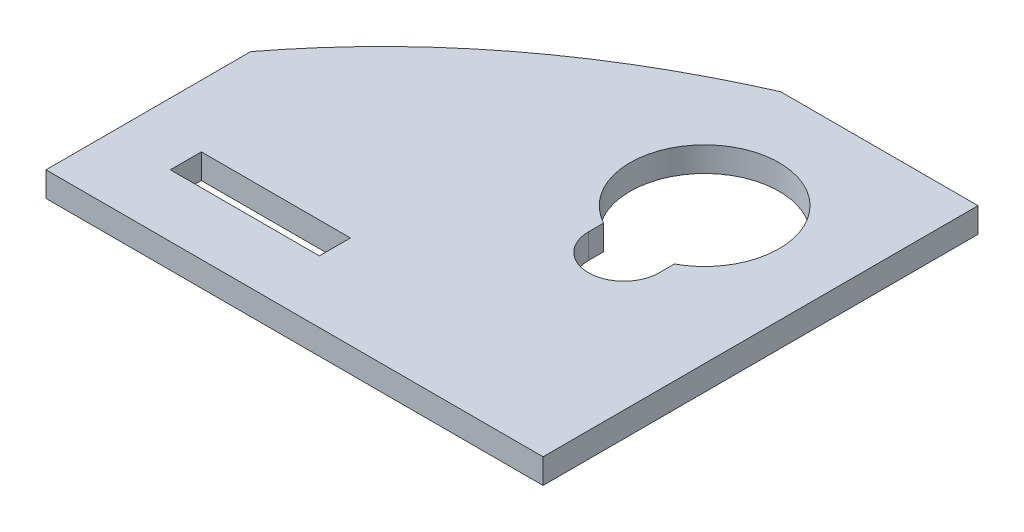
ISO-10303-21;
HEADER;
FILE_DESCRIPTION(('STEP AP214'),'2;1');
FILE_NAME('part.step','',(''),(''),'','','');
FILE_SCHEMA(('AUTOMOTIVE_DESIGN { 1 0 10303 214 1 1 1 1 }'));
ENDSEC;
DATA;
#1=APPLICATION_CONTEXT('core data for automotive mechanical design processes');
#2=APPLICATION_PROTOCOL_DEFINITION('international standard','automotive_design',2000,#1);
#3=PRODUCT_CONTEXT('',#1,'mechanical');
#4=PRODUCT('Part','Part','',(#3));
#5=PRODUCT_RELATED_PRODUCT_CATEGORY('part','',(#4));
#6=PRODUCT_DEFINITION_FORMATION('','',#4);
#7=PRODUCT_DEFINITION_CONTEXT('part definition',#1,'design');
#8=PRODUCT_DEFINITION('design','',#6,#7);
#9=PRODUCT_DEFINITION_SHAPE('','',#8);
#10=(LENGTH_UNIT() NAMED_UNIT(*) SI_UNIT(.MILLI.,.METRE.));
#11=(NAMED_UNIT(*) PLANE_ANGLE_UNIT() SI_UNIT($,.RADIAN.));
#12=(NAMED_UNIT(*) SI_UNIT($,.STERADIAN.) SOLID_ANGLE_UNIT());
#13=UNCERTAINTY_MEASURE_WITH_UNIT(LENGTH_MEASURE(1.E-05),#10,'distance_accuracy_value','');
#14=(GEOMETRIC_REPRESENTATION_CONTEXT(3) GLOBAL_UNCERTAINTY_ASSIGNED_CONTEXT((#13)) GLOBAL_UNIT_ASSIGNED_CONTEXT((#10,
#11,#12)) REPRESENTATION_CONTEXT('',''));
#15=CARTESIAN_POINT('',(0.,0.,0.));
#16=DIRECTION('',(0.,0.,1.));
#17=DIRECTION('',(1.,0.,0.));
#18=AXIS2_PLACEMENT_3D('',#15,#16,#17);
#19=CARTESIAN_POINT('',(0.,2.,0.));
#20=DIRECTION('',(0.,-1.,0.));
#21=DIRECTION('',(0.,0.,-1.));
#22=AXIS2_PLACEMENT_3D('',#19,#20,#21);
#23=PLANE('',#22);
#24=CARTESIAN_POINT('',(9.00000000000001,2.,0.));
#25=DIRECTION('',(0.,1.,0.));
#26=DIRECTION('',(0.,0.,1.));
#27=AXIS2_PLACEMENT_3D('',#24,#25,#26);
#28=CIRCLE('',#27,2.85);
#29=CARTESIAN_POINT('',(6.15000000000001,2.,0.));
#30=VERTEX_POINT('',#29);
#31=CARTESIAN_POINT('',(11.85,2.,0.));
#32=VERTEX_POINT('',#31);
#33=EDGE_CURVE('E212',#30,#32,#28,.T.);
#34=ORIENTED_EDGE('',*,*,#33,.F.);
#35=DIRECTION('',(0.,0.,1.));
#36=VECTOR('',#35,1.);
#37=CARTESIAN_POINT('',(6.15000000000001,2.,-1.2200852279606));
#38=LINE('',#37,#36);
#39=CARTESIAN_POINT('',(6.15000000000001,2.,-1.2200852279606));
#40=VERTEX_POINT('',#39);
#41=EDGE_CURVE('E220',#40,#30,#38,.T.);
#42=ORIENTED_EDGE('',*,*,#41,.F.);
#43=CARTESIAN_POINT('',(9.00000000000001,2.,-6.50000000000001));
#44=DIRECTION('',(0.,1.,0.));
#45=DIRECTION('',(0.,0.,1.));
#46=AXIS2_PLACEMENT_3D('',#43,#44,#45);
#47=CIRCLE('',#46,6.);
#48=CARTESIAN_POINT('',(11.85,2.,-1.2200852279606));
#49=VERTEX_POINT('',#48);
#50=EDGE_CURVE('E217',#49,#40,#47,.T.);
#51=ORIENTED_EDGE('',*,*,#50,.F.);
#52=DIRECTION('',(0.,0.,-1.));
#53=VECTOR('',#52,1.);
#54=CARTESIAN_POINT('',(11.85,2.,-1.2200852279606));
#55=LINE('',#54,#53);
#56=EDGE_CURVE('E214',#32,#49,#55,.T.);
#57=ORIENTED_EDGE('',*,*,#56,.F.);
#58=EDGE_LOOP('',(#34,#42,#51,#57));
#59=FACE_BOUND('',#58,.T.);
#60=DIRECTION('',(-1.,0.,0.));
#61=VECTOR('',#60,1.);
#62=CARTESIAN_POINT('',(-20.,2.,-17.5));
#63=LINE('',#62,#61);
#64=CARTESIAN_POINT('',(20.,2.,-17.5));
#65=VERTEX_POINT('',#64);
#66=CARTESIAN_POINT('',(4.11660053716541,2.,-17.5));
#67=VERTEX_POINT('',#66);
#68=EDGE_CURVE('E137',#65,#67,#63,.T.);
#69=ORIENTED_EDGE('',*,*,#68,.T.);
#70=CARTESIAN_POINT('',(-28.7452278888274,2.,17.5));
#71=CARTESIAN_POINT('',(-20.2628649110153,2.,-6.72067736772361));
#72=CARTESIAN_POINT('',(4.11660053716541,2.,-17.5));
#73=B_SPLINE_CURVE_WITH_KNOTS('',2,(#70,#71,#72),.UNSPECIFIED.,.F.,.F.,(3,3),(0.,1.),.UNSPECIFIED.);
#74=CARTESIAN_POINT('',(-20.0000000004594,2.,1.02915013489577));
#75=VERTEX_POINT('',#74);
#76=EDGE_CURVE('E125',#75,#67,#73,.T.);
#77=ORIENTED_EDGE('',*,*,#76,.F.);
#78=DIRECTION('',(0.,0.,1.));
#79=VECTOR('',#78,1.);
#80=CARTESIAN_POINT('',(-20.,2.,17.5));
#81=LINE('',#80,#79);
#82=CARTESIAN_POINT('',(-20.,2.,17.5));
#83=VERTEX_POINT('',#82);
#84=EDGE_CURVE('E145',#75,#83,#81,.T.);
#85=ORIENTED_EDGE('',*,*,#84,.T.);
#86=DIRECTION('',(1.,0.,0.));
#87=VECTOR('',#86,1.);
#88=CARTESIAN_POINT('',(-20.,2.,17.5));
#89=LINE('',#88,#87);
#90=CARTESIAN_POINT('',(20.,2.,17.5));
#91=VERTEX_POINT('',#90);
#92=EDGE_CURVE('E147',#83,#91,#89,.T.);
#93=ORIENTED_EDGE('',*,*,#92,.T.);
#94=DIRECTION('',(0.,0.,-1.));
#95=VECTOR('',#94,1.);
#96=CARTESIAN_POINT('',(20.,2.,17.5));
#97=LINE('',#96,#95);
#98=EDGE_CURVE('E143',#91,#65,#97,.T.);
#99=ORIENTED_EDGE('',*,*,#98,.T.);
#100=EDGE_LOOP('',(#69,#77,#85,#93,#99));
#101=FACE_BOUND('',#100,.T.);
#102=DIRECTION('',(0.,0.,1.));
#103=VECTOR('',#102,1.);
#104=CARTESIAN_POINT('',(-15.,2.,12.5));
#105=LINE('',#104,#103);
#106=CARTESIAN_POINT('',(-15.,2.,9.99999999999999));
#107=VERTEX_POINT('',#106);
#108=CARTESIAN_POINT('',(-15.,2.,12.5));
#109=VERTEX_POINT('',#108);
#110=EDGE_CURVE('E183',#107,#109,#105,.T.);
#111=ORIENTED_EDGE('',*,*,#110,.F.);
#112=DIRECTION('',(-1.,0.,0.));
#113=VECTOR('',#112,1.);
#114=CARTESIAN_POINT('',(-15.,2.,9.99999999999999));
#115=LINE('',#114,#113);
#116=CARTESIAN_POINT('',(-2.99999999999999,2.,9.99999999999999));
#117=VERTEX_POINT('',#116);
#118=EDGE_CURVE('E193',#117,#107,#115,.T.);
#119=ORIENTED_EDGE('',*,*,#118,.F.);
#120=DIRECTION('',(0.,0.,-1.));
#121=VECTOR('',#120,1.);
#122=CARTESIAN_POINT('',(-2.99999999999999,2.,12.5));
#123=LINE('',#122,#121);
#124=CARTESIAN_POINT('',(-2.99999999999999,2.,12.5));
#125=VERTEX_POINT('',#124);
#126=EDGE_CURVE('E191',#125,#117,#123,.T.);
#127=ORIENTED_EDGE('',*,*,#126,.F.);
#128=DIRECTION('',(1.,0.,0.));
#129=VECTOR('',#128,1.);
#130=CARTESIAN_POINT('',(-15.,2.,12.5));
#131=LINE('',#130,#129);
#132=EDGE_CURVE('E188',#109,#125,#131,.T.);
#133=ORIENTED_EDGE('',*,*,#132,.F.);
#134=EDGE_LOOP('',(#111,#119,#127,#133));
#135=FACE_BOUND('',#134,.T.);
#136=ADVANCED_FACE('F33',(#59,#101,#135),#23,.F.);
#137=CARTESIAN_POINT('',(0.,0.,0.));
#138=DIRECTION('',(0.,-1.,0.));
#139=DIRECTION('',(0.,0.,-1.));
#140=AXIS2_PLACEMENT_3D('',#137,#138,#139);
#141=PLANE('',#140);
#142=CARTESIAN_POINT('',(-28.7452278888274,0.,17.5));
#143=CARTESIAN_POINT('',(-20.2628649110153,0.,-6.72067736772361));
#144=CARTESIAN_POINT('',(4.11660053716541,0.,-17.5));
#145=B_SPLINE_CURVE_WITH_KNOTS('',2,(#142,#143,#144),.UNSPECIFIED.,.F.,.F.,(3,3),(0.,1.),.UNSPECIFIED.);
#146=CARTESIAN_POINT('',(4.11660053716541,0.,-17.5));
#147=VERTEX_POINT('',#146);
#148=CARTESIAN_POINT('',(-20.,0.,1.02915013429133));
#149=VERTEX_POINT('',#148);
#150=EDGE_CURVE('E48',#147,#149,#145,.F.);
#151=ORIENTED_EDGE('',*,*,#150,.F.);
#152=DIRECTION('',(-1.,0.,0.));
#153=VECTOR('',#152,1.);
#154=CARTESIAN_POINT('',(-20.,0.,-17.5));
#155=LINE('',#154,#153);
#156=CARTESIAN_POINT('',(20.,0.,-17.5));
#157=VERTEX_POINT('',#156);
#158=EDGE_CURVE('E139',#157,#147,#155,.T.);
#159=ORIENTED_EDGE('',*,*,#158,.F.);
#160=DIRECTION('',(0.,0.,-1.));
#161=VECTOR('',#160,1.);
#162=CARTESIAN_POINT('',(20.,0.,17.5));
#163=LINE('',#162,#161);
#164=CARTESIAN_POINT('',(20.,0.,17.5));
#165=VERTEX_POINT('',#164);
#166=EDGE_CURVE('E155',#165,#157,#163,.T.);
#167=ORIENTED_EDGE('',*,*,#166,.F.);
#168=DIRECTION('',(1.,0.,0.));
#169=VECTOR('',#168,1.);
#170=CARTESIAN_POINT('',(-20.,0.,17.5));
#171=LINE('',#170,#169);
#172=CARTESIAN_POINT('',(-20.,0.,17.5));
#173=VERTEX_POINT('',#172);
#174=EDGE_CURVE('E149',#173,#165,#171,.T.);
#175=ORIENTED_EDGE('',*,*,#174,.F.);
#176=DIRECTION('',(0.,0.,1.));
#177=VECTOR('',#176,1.);
#178=CARTESIAN_POINT('',(-20.,0.,17.5));
#179=LINE('',#178,#177);
#180=EDGE_CURVE('E160',#149,#173,#179,.T.);
#181=ORIENTED_EDGE('',*,*,#180,.F.);
#182=EDGE_LOOP('',(#151,#159,#167,#175,#181));
#183=FACE_BOUND('',#182,.T.);
#184=DIRECTION('',(0.,0.,1.));
#185=VECTOR('',#184,1.);
#186=CARTESIAN_POINT('',(6.15000000000001,0.,-1.2200852279606));
#187=LINE('',#186,#185);
#188=CARTESIAN_POINT('',(6.15,0.,-1.2200852279606));
#189=VERTEX_POINT('',#188);
#190=CARTESIAN_POINT('',(6.15000000000001,0.,0.));
#191=VERTEX_POINT('',#190);
#192=EDGE_CURVE('E215',#189,#191,#187,.T.);
#193=ORIENTED_EDGE('',*,*,#192,.T.);
#194=CARTESIAN_POINT('',(9.00000000000001,0.,0.));
#195=DIRECTION('',(0.,1.,0.));
#196=DIRECTION('',(0.,0.,1.));
#197=AXIS2_PLACEMENT_3D('',#194,#195,#196);
#198=CIRCLE('',#197,2.85);
#199=CARTESIAN_POINT('',(11.85,0.,0.));
#200=VERTEX_POINT('',#199);
#201=EDGE_CURVE('E211',#191,#200,#198,.T.);
#202=ORIENTED_EDGE('',*,*,#201,.T.);
#203=DIRECTION('',(0.,0.,-1.));
#204=VECTOR('',#203,1.);
#205=CARTESIAN_POINT('',(11.85,0.,-1.2200852279606));
#206=LINE('',#205,#204);
#207=CARTESIAN_POINT('',(11.85,0.,-1.2200852279606));
#208=VERTEX_POINT('',#207);
#209=EDGE_CURVE('E225',#200,#208,#206,.T.);
#210=ORIENTED_EDGE('',*,*,#209,.T.);
#211=CARTESIAN_POINT('',(9.00000000000001,0.,-6.50000000000001));
#212=DIRECTION('',(0.,1.,0.));
#213=DIRECTION('',(0.,0.,1.));
#214=AXIS2_PLACEMENT_3D('',#211,#212,#213);
#215=CIRCLE('',#214,6.);
#216=EDGE_CURVE('E228',#208,#189,#215,.T.);
#217=ORIENTED_EDGE('',*,*,#216,.T.);
#218=EDGE_LOOP('',(#193,#202,#210,#217));
#219=FACE_BOUND('',#218,.T.);
#220=DIRECTION('',(-1.,0.,0.));
#221=VECTOR('',#220,1.);
#222=CARTESIAN_POINT('',(-15.,0.,9.99999999999999));
#223=LINE('',#222,#221);
#224=CARTESIAN_POINT('',(-2.99999999999999,0.,9.99999999999999));
#225=VERTEX_POINT('',#224);
#226=CARTESIAN_POINT('',(-15.,0.,9.99999999999999));
#227=VERTEX_POINT('',#226);
#228=EDGE_CURVE('E189',#225,#227,#223,.T.);
#229=ORIENTED_EDGE('',*,*,#228,.T.);
#230=DIRECTION('',(0.,0.,1.));
#231=VECTOR('',#230,1.);
#232=CARTESIAN_POINT('',(-15.,0.,12.5));
#233=LINE('',#232,#231);
#234=CARTESIAN_POINT('',(-15.,0.,12.5));
#235=VERTEX_POINT('',#234);
#236=EDGE_CURVE('E175',#227,#235,#233,.T.);
#237=ORIENTED_EDGE('',*,*,#236,.T.);
#238=DIRECTION('',(1.,0.,0.));
#239=VECTOR('',#238,1.);
#240=CARTESIAN_POINT('',(-15.,0.,12.5));
#241=LINE('',#240,#239);
#242=CARTESIAN_POINT('',(-2.99999999999999,0.,12.5));
#243=VERTEX_POINT('',#242);
#244=EDGE_CURVE('E178',#235,#243,#241,.T.);
#245=ORIENTED_EDGE('',*,*,#244,.T.);
#246=DIRECTION('',(0.,0.,-1.));
#247=VECTOR('',#246,1.);
#248=CARTESIAN_POINT('',(-2.99999999999999,0.,12.5));
#249=LINE('',#248,#247);
#250=EDGE_CURVE('E198',#243,#225,#249,.T.);
#251=ORIENTED_EDGE('',*,*,#250,.T.);
#252=EDGE_LOOP('',(#229,#237,#245,#251));
#253=FACE_BOUND('',#252,.T.);
#254=ADVANCED_FACE('F172',(#183,#219,#253),#141,.T.);
#255=CARTESIAN_POINT('',(20.,2.,17.5));
#256=DIRECTION('',(-1.,0.,0.));
#257=DIRECTION('',(0.,0.,1.));
#258=AXIS2_PLACEMENT_3D('',#255,#256,#257);
#259=PLANE('',#258);
#260=ORIENTED_EDGE('',*,*,#166,.T.);
#261=DIRECTION('',(0.,-1.,0.));
#262=VECTOR('',#261,1.);
#263=CARTESIAN_POINT('',(20.,2.,-17.5));
#264=LINE('',#263,#262);
#265=EDGE_CURVE('E41',#65,#157,#264,.T.);
#266=ORIENTED_EDGE('',*,*,#265,.F.);
#267=ORIENTED_EDGE('',*,*,#98,.F.);
#268=DIRECTION('',(0.,-1.,0.));
#269=VECTOR('',#268,1.);
#270=CARTESIAN_POINT('',(20.,2.,17.5));
#271=LINE('',#270,#269);
#272=EDGE_CURVE('E154',#91,#165,#271,.T.);
#273=ORIENTED_EDGE('',*,*,#272,.T.);
#274=EDGE_LOOP('',(#260,#266,#267,#273));
#275=FACE_BOUND('',#274,.T.);
#276=ADVANCED_FACE('F35',(#275),#259,.F.);
#277=CARTESIAN_POINT('',(-20.,2.,-17.5));
#278=DIRECTION('',(0.,0.,1.));
#279=DIRECTION('',(1.,0.,0.));
#280=AXIS2_PLACEMENT_3D('',#277,#278,#279);
#281=PLANE('',#280);
#282=ORIENTED_EDGE('',*,*,#158,.T.);
#283=DIRECTION('',(0.,1.,0.));
#284=VECTOR('',#283,1.);
#285=CARTESIAN_POINT('',(4.11660053716541,-8.,-17.5));
#286=LINE('',#285,#284);
#287=EDGE_CURVE('E128',#147,#67,#286,.T.);
#288=ORIENTED_EDGE('',*,*,#287,.T.);
#289=ORIENTED_EDGE('',*,*,#68,.F.);
#290=ORIENTED_EDGE('',*,*,#265,.T.);
#291=EDGE_LOOP('',(#282,#288,#289,#290));
#292=FACE_BOUND('',#291,.T.);
#293=ADVANCED_FACE('F135',(#292),#281,.F.);
#294=CARTESIAN_POINT('',(-20.,2.,17.5));
#295=DIRECTION('',(1.,0.,0.));
#296=DIRECTION('',(0.,0.,-1.));
#297=AXIS2_PLACEMENT_3D('',#294,#295,#296);
#298=PLANE('',#297);
#299=ORIENTED_EDGE('',*,*,#84,.F.);
#300=DIRECTION('',(0.,1.,0.));
#301=VECTOR('',#300,1.);
#302=CARTESIAN_POINT('',(-20.,-8.,1.02915013429133));
#303=LINE('',#302,#301);
#304=EDGE_CURVE('E11',#75,#149,#303,.F.);
#305=ORIENTED_EDGE('',*,*,#304,.T.);
#306=ORIENTED_EDGE('',*,*,#180,.T.);
#307=DIRECTION('',(0.,-1.,0.));
#308=VECTOR('',#307,1.);
#309=CARTESIAN_POINT('',(-20.,2.,17.5));
#310=LINE('',#309,#308);
#311=EDGE_CURVE('E165',#83,#173,#310,.T.);
#312=ORIENTED_EDGE('',*,*,#311,.F.);
#313=EDGE_LOOP('',(#299,#305,#306,#312));
#314=FACE_BOUND('',#313,.T.);
#315=ADVANCED_FACE('F278',(#314),#298,.F.);
#316=CARTESIAN_POINT('',(-20.,2.,17.5));
#317=DIRECTION('',(0.,0.,-1.));
#318=DIRECTION('',(-1.,0.,0.));
#319=AXIS2_PLACEMENT_3D('',#316,#317,#318);
#320=PLANE('',#319);
#321=ORIENTED_EDGE('',*,*,#174,.T.);
#322=ORIENTED_EDGE('',*,*,#272,.F.);
#323=ORIENTED_EDGE('',*,*,#92,.F.);
#324=ORIENTED_EDGE('',*,*,#311,.T.);
#325=EDGE_LOOP('',(#321,#322,#323,#324));
#326=FACE_BOUND('',#325,.T.);
#327=ADVANCED_FACE('F275',(#326),#320,.F.);
#328=CARTESIAN_POINT('',(9.00000000000001,2.,0.));
#329=DIRECTION('',(0.,-1.,0.));
#330=DIRECTION('',(0.,0.,-1.));
#331=AXIS2_PLACEMENT_3D('',#328,#329,#330);
#332=CYLINDRICAL_SURFACE('',#331,2.85);
#333=ORIENTED_EDGE('',*,*,#201,.F.);
#334=DIRECTION('',(0.,-1.,0.));
#335=VECTOR('',#334,1.);
#336=CARTESIAN_POINT('',(6.15000000000001,2.,0.));
#337=LINE('',#336,#335);
#338=EDGE_CURVE('E222',#30,#191,#337,.T.);
#339=ORIENTED_EDGE('',*,*,#338,.F.);
#340=ORIENTED_EDGE('',*,*,#33,.T.);
#341=DIRECTION('',(0.,-1.,0.));
#342=VECTOR('',#341,1.);
#343=CARTESIAN_POINT('',(11.85,2.,0.));
#344=LINE('',#343,#342);
#345=EDGE_CURVE('E158',#32,#200,#344,.T.);
#346=ORIENTED_EDGE('',*,*,#345,.T.);
#347=EDGE_LOOP('',(#333,#339,#340,#346));
#348=FACE_BOUND('',#347,.T.);
#349=ADVANCED_FACE('F241',(#348),#332,.F.);
#350=CARTESIAN_POINT('',(11.85,2.,-1.2200852279606));
#351=DIRECTION('',(-1.,0.,0.));
#352=DIRECTION('',(0.,0.,1.));
#353=AXIS2_PLACEMENT_3D('',#350,#351,#352);
#354=PLANE('',#353);
#355=ORIENTED_EDGE('',*,*,#209,.F.);
#356=ORIENTED_EDGE('',*,*,#345,.F.);
#357=ORIENTED_EDGE('',*,*,#56,.T.);
#358=DIRECTION('',(0.,-1.,0.));
#359=VECTOR('',#358,1.);
#360=CARTESIAN_POINT('',(11.85,2.,-1.2200852279606));
#361=LINE('',#360,#359);
#362=EDGE_CURVE('E237',#49,#208,#361,.T.);
#363=ORIENTED_EDGE('',*,*,#362,.T.);
#364=EDGE_LOOP('',(#355,#356,#357,#363));
#365=FACE_BOUND('',#364,.T.);
#366=ADVANCED_FACE('F255',(#365),#354,.T.);
#367=CARTESIAN_POINT('',(9.00000000000001,2.,-6.50000000000001));
#368=DIRECTION('',(0.,-1.,0.));
#369=DIRECTION('',(0.,0.,-1.));
#370=AXIS2_PLACEMENT_3D('',#367,#368,#369);
#371=CYLINDRICAL_SURFACE('',#370,6.);
#372=ORIENTED_EDGE('',*,*,#216,.F.);
#373=ORIENTED_EDGE('',*,*,#362,.F.);
#374=ORIENTED_EDGE('',*,*,#50,.T.);
#375=DIRECTION('',(0.,-1.,0.));
#376=VECTOR('',#375,1.);
#377=CARTESIAN_POINT('',(6.15,2.,-1.2200852279606));
#378=LINE('',#377,#376);
#379=EDGE_CURVE('E235',#40,#189,#378,.T.);
#380=ORIENTED_EDGE('',*,*,#379,.T.);
#381=EDGE_LOOP('',(#372,#373,#374,#380));
#382=FACE_BOUND('',#381,.T.);
#383=ADVANCED_FACE('F257',(#382),#371,.F.);
#384=CARTESIAN_POINT('',(6.15000000000001,2.,-1.2200852279606));
#385=DIRECTION('',(1.,0.,0.));
#386=DIRECTION('',(0.,0.,-1.));
#387=AXIS2_PLACEMENT_3D('',#384,#385,#386);
#388=PLANE('',#387);
#389=ORIENTED_EDGE('',*,*,#192,.F.);
#390=ORIENTED_EDGE('',*,*,#379,.F.);
#391=ORIENTED_EDGE('',*,*,#41,.T.);
#392=ORIENTED_EDGE('',*,*,#338,.T.);
#393=EDGE_LOOP('',(#389,#390,#391,#392));
#394=FACE_BOUND('',#393,.T.);
#395=ADVANCED_FACE('F250',(#394),#388,.T.);
#396=CARTESIAN_POINT('',(-15.,2.,12.5));
#397=DIRECTION('',(1.,0.,0.));
#398=DIRECTION('',(0.,0.,-1.));
#399=AXIS2_PLACEMENT_3D('',#396,#397,#398);
#400=PLANE('',#399);
#401=ORIENTED_EDGE('',*,*,#236,.F.);
#402=DIRECTION('',(0.,-1.,0.));
#403=VECTOR('',#402,1.);
#404=CARTESIAN_POINT('',(-15.,2.,9.99999999999999));
#405=LINE('',#404,#403);
#406=EDGE_CURVE('E194',#107,#227,#405,.T.);
#407=ORIENTED_EDGE('',*,*,#406,.F.);
#408=ORIENTED_EDGE('',*,*,#110,.T.);
#409=DIRECTION('',(0.,-1.,0.));
#410=VECTOR('',#409,1.);
#411=CARTESIAN_POINT('',(-15.,2.,12.5));
#412=LINE('',#411,#410);
#413=EDGE_CURVE('E208',#109,#235,#412,.T.);
#414=ORIENTED_EDGE('',*,*,#413,.T.);
#415=EDGE_LOOP('',(#401,#407,#408,#414));
#416=FACE_BOUND('',#415,.T.);
#417=ADVANCED_FACE('F264',(#416),#400,.T.);
#418=CARTESIAN_POINT('',(-15.,2.,12.5));
#419=DIRECTION('',(0.,0.,-1.));
#420=DIRECTION('',(-1.,0.,0.));
#421=AXIS2_PLACEMENT_3D('',#418,#419,#420);
#422=PLANE('',#421);
#423=ORIENTED_EDGE('',*,*,#244,.F.);
#424=ORIENTED_EDGE('',*,*,#413,.F.);
#425=ORIENTED_EDGE('',*,*,#132,.T.);
#426=DIRECTION('',(0.,-1.,0.));
#427=VECTOR('',#426,1.);
#428=CARTESIAN_POINT('',(-2.99999999999999,2.,12.5));
#429=LINE('',#428,#427);
#430=EDGE_CURVE('E206',#125,#243,#429,.T.);
#431=ORIENTED_EDGE('',*,*,#430,.T.);
#432=EDGE_LOOP('',(#423,#424,#425,#431));
#433=FACE_BOUND('',#432,.T.);
#434=ADVANCED_FACE('F330',(#433),#422,.T.);
#435=CARTESIAN_POINT('',(-2.99999999999999,2.,12.5));
#436=DIRECTION('',(-1.,0.,0.));
#437=DIRECTION('',(0.,0.,1.));
#438=AXIS2_PLACEMENT_3D('',#435,#436,#437);
#439=PLANE('',#438);
#440=ORIENTED_EDGE('',*,*,#250,.F.);
#441=ORIENTED_EDGE('',*,*,#430,.F.);
#442=ORIENTED_EDGE('',*,*,#126,.T.);
#443=DIRECTION('',(0.,-1.,0.));
#444=VECTOR('',#443,1.);
#445=CARTESIAN_POINT('',(-2.99999999999999,2.,9.99999999999999));
#446=LINE('',#445,#444);
#447=EDGE_CURVE('E55',#117,#225,#446,.T.);
#448=ORIENTED_EDGE('',*,*,#447,.T.);
#449=EDGE_LOOP('',(#440,#441,#442,#448));
#450=FACE_BOUND('',#449,.T.);
#451=ADVANCED_FACE('F324',(#450),#439,.T.);
#452=CARTESIAN_POINT('',(-15.,2.,9.99999999999999));
#453=DIRECTION('',(0.,0.,1.));
#454=DIRECTION('',(1.,0.,0.));
#455=AXIS2_PLACEMENT_3D('',#452,#453,#454);
#456=PLANE('',#455);
#457=ORIENTED_EDGE('',*,*,#228,.F.);
#458=ORIENTED_EDGE('',*,*,#447,.F.);
#459=ORIENTED_EDGE('',*,*,#118,.T.);
#460=ORIENTED_EDGE('',*,*,#406,.T.);
#461=EDGE_LOOP('',(#457,#458,#459,#460));
#462=FACE_BOUND('',#461,.T.);
#463=ADVANCED_FACE('F315',(#462),#456,.T.);
#464=CARTESIAN_POINT('',(-28.7452278888274,-8.,17.5));
#465=CARTESIAN_POINT('',(-20.2628649110153,-8.,-6.72067736772361));
#466=CARTESIAN_POINT('',(4.11660053716541,-8.,-17.5));
#467=B_SPLINE_CURVE_WITH_KNOTS('',2,(#464,#465,#466),.UNSPECIFIED.,.F.,.F.,(3,3),(0.,1.),.UNSPECIFIED.);
#468=DIRECTION('',(0.,1.,0.));
#469=VECTOR('',#468,1.);
#470=SURFACE_OF_LINEAR_EXTRUSION('',#467,#469);
#471=ORIENTED_EDGE('',*,*,#150,.T.);
#472=ORIENTED_EDGE('',*,*,#304,.F.);
#473=ORIENTED_EDGE('',*,*,#76,.T.);
#474=ORIENTED_EDGE('',*,*,#287,.F.);
#475=EDGE_LOOP('',(#471,#472,#473,#474));
#476=FACE_BOUND('',#475,.T.);
#477=ADVANCED_FACE('F127',(#476),#470,.F.);
#478=CLOSED_SHELL('',(#136,#254,#276,#293,#315,#327,#349,#366,#383,#395,#417,#434,#451,#463,#477));
#479=MANIFOLD_SOLID_BREP('B2',#478);
#480=ADVANCED_BREP_SHAPE_REPRESENTATION('',(#18,#479),#14);
#481=SHAPE_DEFINITION_REPRESENTATION(#9,#480);
ENDSEC;
END-ISO-10303-21;
